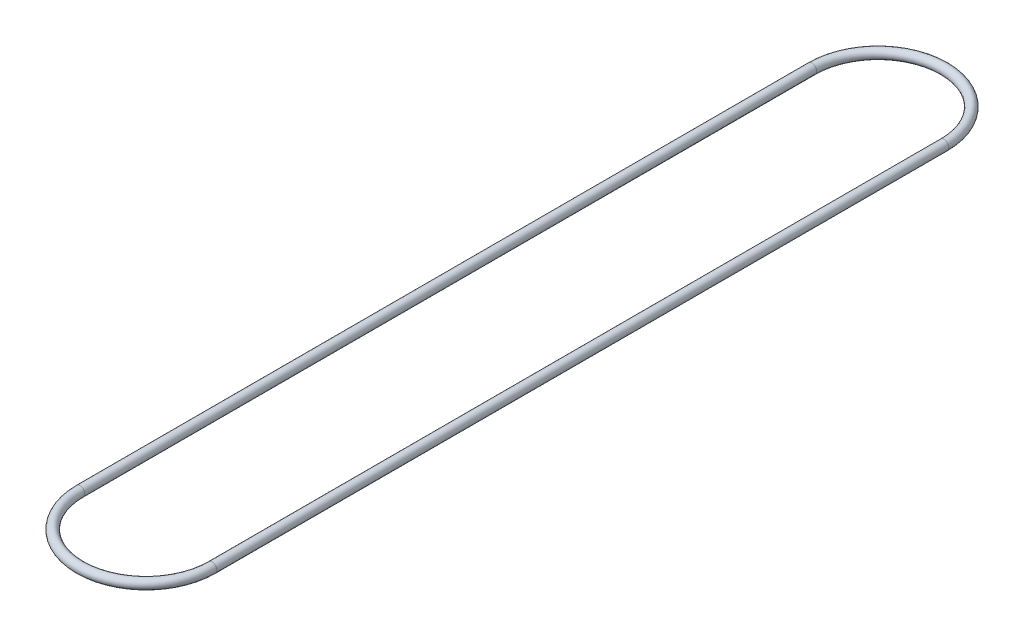
ISO-10303-21;
HEADER;
FILE_DESCRIPTION(('STEP AP214'),'2;1');
FILE_NAME('part.step','',(''),(''),'','','');
FILE_SCHEMA(('AUTOMOTIVE_DESIGN { 1 0 10303 214 1 1 1 1 }'));
ENDSEC;
DATA;
#1=APPLICATION_CONTEXT('core data for automotive mechanical design processes');
#2=APPLICATION_PROTOCOL_DEFINITION('international standard','automotive_design',2000,#1);
#3=PRODUCT_CONTEXT('',#1,'mechanical');
#4=PRODUCT('Part','Part','',(#3));
#5=PRODUCT_RELATED_PRODUCT_CATEGORY('part','',(#4));
#6=PRODUCT_DEFINITION_FORMATION('','',#4);
#7=PRODUCT_DEFINITION_CONTEXT('part definition',#1,'design');
#8=PRODUCT_DEFINITION('design','',#6,#7);
#9=PRODUCT_DEFINITION_SHAPE('','',#8);
#10=(LENGTH_UNIT() NAMED_UNIT(*) SI_UNIT(.MILLI.,.METRE.));
#11=(NAMED_UNIT(*) PLANE_ANGLE_UNIT() SI_UNIT($,.RADIAN.));
#12=(NAMED_UNIT(*) SI_UNIT($,.STERADIAN.) SOLID_ANGLE_UNIT());
#13=UNCERTAINTY_MEASURE_WITH_UNIT(LENGTH_MEASURE(1.E-05),#10,'distance_accuracy_value','');
#14=(GEOMETRIC_REPRESENTATION_CONTEXT(3) GLOBAL_UNCERTAINTY_ASSIGNED_CONTEXT((#13)) GLOBAL_UNIT_ASSIGNED_CONTEXT((#10,
#11,#12)) REPRESENTATION_CONTEXT('',''));
#15=CARTESIAN_POINT('',(0.,0.,0.));
#16=DIRECTION('',(0.,0.,1.));
#17=DIRECTION('',(1.,0.,0.));
#18=AXIS2_PLACEMENT_3D('',#15,#16,#17);
#19=CARTESIAN_POINT('',(0.274999999999999,2.5,1.54727793696275));
#20=DIRECTION('',(0.,0.,-1.));
#21=DIRECTION('',(-1.,0.,0.));
#22=AXIS2_PLACEMENT_3D('',#19,#20,#21);
#23=CYLINDRICAL_SURFACE('',#22,0.02);
#24=CARTESIAN_POINT('',(0.274999999999999,2.5,1.54727793696275));
#25=DIRECTION('',(0.,0.,1.));
#26=DIRECTION('',(1.,0.,0.));
#27=AXIS2_PLACEMENT_3D('',#24,#25,#26);
#28=CIRCLE('',#27,0.02);
#29=CARTESIAN_POINT('',(0.294999999999999,2.5,1.54727793696275));
#30=VERTEX_POINT('',#29);
#31=EDGE_CURVE('E36',#30,#30,#28,.T.);
#32=ORIENTED_EDGE('',*,*,#31,.F.);
#33=EDGE_LOOP('',(#32));
#34=FACE_BOUND('',#33,.T.);
#35=CARTESIAN_POINT('',(0.274999999999999,2.5,-1.5));
#36=DIRECTION('',(0.,0.,1.));
#37=DIRECTION('',(1.,0.,0.));
#38=AXIS2_PLACEMENT_3D('',#35,#36,#37);
#39=CIRCLE('',#38,0.02);
#40=CARTESIAN_POINT('',(0.294999999999999,2.5,-1.5));
#41=VERTEX_POINT('',#40);
#42=EDGE_CURVE('E10',#41,#41,#39,.T.);
#43=ORIENTED_EDGE('',*,*,#42,.T.);
#44=EDGE_LOOP('',(#43));
#45=FACE_BOUND('',#44,.T.);
#46=ADVANCED_FACE('F30',(#34,#45),#23,.T.);
#47=CARTESIAN_POINT('',(0.,2.5,1.54727793696275));
#48=DIRECTION('',(0.,1.,0.));
#49=DIRECTION('',(0.,0.,1.));
#50=AXIS2_PLACEMENT_3D('',#47,#48,#49);
#51=TOROIDAL_SURFACE('',#50,0.274999999999999,0.02);
#52=CARTESIAN_POINT('',(-0.274999999999999,2.5,1.54727793696275));
#53=DIRECTION('',(0.,0.,-1.));
#54=DIRECTION('',(-1.,0.,0.));
#55=AXIS2_PLACEMENT_3D('',#52,#53,#54);
#56=CIRCLE('',#55,0.02);
#57=CARTESIAN_POINT('',(-0.294999999999999,2.5,1.54727793696275));
#58=VERTEX_POINT('',#57);
#59=EDGE_CURVE('E40',#58,#58,#56,.T.);
#60=CARTESIAN_POINT('',(0.,2.5,1.54727793696275));
#61=DIRECTION('',(0.,1.,0.));
#62=DIRECTION('',(0.,0.,1.));
#63=AXIS2_PLACEMENT_3D('',#60,#61,#62);
#64=CIRCLE('',#63,0.294999999999999);
#65=EDGE_CURVE('',#58,#30,#64,.T.);
#66=ORIENTED_EDGE('',*,*,#59,.F.);
#67=ORIENTED_EDGE('',*,*,#31,.T.);
#68=ORIENTED_EDGE('',*,*,#65,.T.);
#69=ORIENTED_EDGE('',*,*,#65,.F.);
#70=EDGE_LOOP('',(#66,#68,#67,#69));
#71=FACE_BOUND('',#70,.T.);
#72=ADVANCED_FACE('F56',(#71),#51,.T.);
#73=CARTESIAN_POINT('',(-0.274999999999999,2.5,-1.5));
#74=DIRECTION('',(0.,0.,1.));
#75=DIRECTION('',(1.,0.,0.));
#76=AXIS2_PLACEMENT_3D('',#73,#74,#75);
#77=CYLINDRICAL_SURFACE('',#76,0.02);
#78=CARTESIAN_POINT('',(-0.274999999999999,2.5,-1.5));
#79=DIRECTION('',(0.,0.,-1.));
#80=DIRECTION('',(-1.,0.,0.));
#81=AXIS2_PLACEMENT_3D('',#78,#79,#80);
#82=CIRCLE('',#81,0.02);
#83=CARTESIAN_POINT('',(-0.294999999999999,2.5,-1.5));
#84=VERTEX_POINT('',#83);
#85=EDGE_CURVE('E44',#84,#84,#82,.T.);
#86=ORIENTED_EDGE('',*,*,#85,.F.);
#87=EDGE_LOOP('',(#86));
#88=FACE_BOUND('',#87,.T.);
#89=ORIENTED_EDGE('',*,*,#59,.T.);
#90=EDGE_LOOP('',(#89));
#91=FACE_BOUND('',#90,.T.);
#92=ADVANCED_FACE('F53',(#88,#91),#77,.T.);
#93=CARTESIAN_POINT('',(0.,2.5,-1.5));
#94=DIRECTION('',(0.,-1.,0.));
#95=DIRECTION('',(0.,0.,-1.));
#96=AXIS2_PLACEMENT_3D('',#93,#94,#95);
#97=TOROIDAL_SURFACE('',#96,0.274999999999999,0.02);
#98=CARTESIAN_POINT('',(0.,2.5,-1.5));
#99=DIRECTION('',(0.,-1.,0.));
#100=DIRECTION('',(0.,0.,-1.));
#101=AXIS2_PLACEMENT_3D('',#98,#99,#100);
#102=CIRCLE('',#101,0.294999999999999);
#103=EDGE_CURVE('',#84,#41,#102,.T.);
#104=ORIENTED_EDGE('',*,*,#85,.T.);
#105=ORIENTED_EDGE('',*,*,#42,.F.);
#106=ORIENTED_EDGE('',*,*,#103,.T.);
#107=ORIENTED_EDGE('',*,*,#103,.F.);
#108=EDGE_LOOP('',(#104,#106,#105,#107));
#109=FACE_BOUND('',#108,.T.);
#110=ADVANCED_FACE('F50',(#109),#97,.T.);
#111=CLOSED_SHELL('',(#46,#72,#92,#110));
#112=MANIFOLD_SOLID_BREP('B2',#111);
#113=ADVANCED_BREP_SHAPE_REPRESENTATION('',(#18,#112),#14);
#114=SHAPE_DEFINITION_REPRESENTATION(#9,#113);
ENDSEC;
END-ISO-10303-21;
